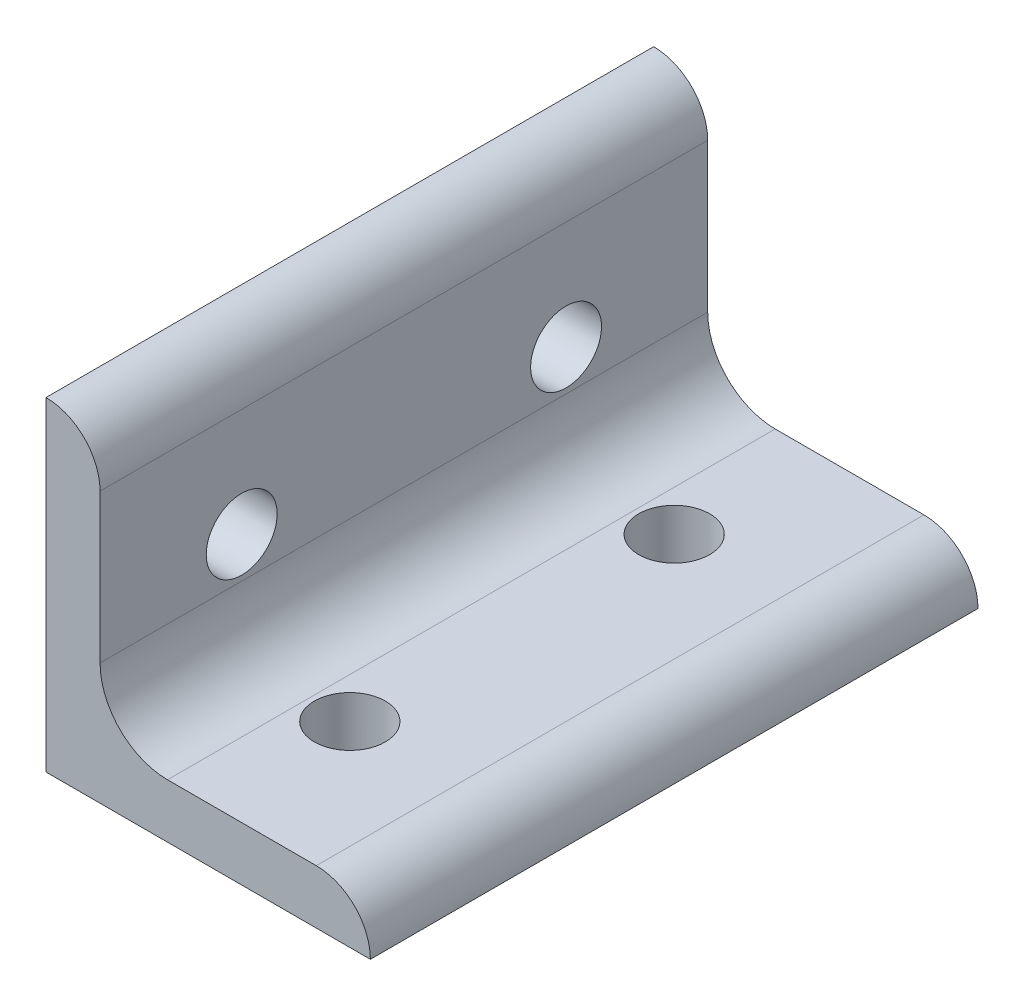
ISO-10303-21;
HEADER;
FILE_DESCRIPTION(('STEP AP214'),'2;1');
FILE_NAME('part.step','',(''),(''),'','','');
FILE_SCHEMA(('AUTOMOTIVE_DESIGN { 1 0 10303 214 1 1 1 1 }'));
ENDSEC;
DATA;
#1=APPLICATION_CONTEXT('core data for automotive mechanical design processes');
#2=APPLICATION_PROTOCOL_DEFINITION('international standard','automotive_design',2000,#1);
#3=PRODUCT_CONTEXT('',#1,'mechanical');
#4=PRODUCT('Part','Part','',(#3));
#5=PRODUCT_RELATED_PRODUCT_CATEGORY('part','',(#4));
#6=PRODUCT_DEFINITION_FORMATION('','',#4);
#7=PRODUCT_DEFINITION_CONTEXT('part definition',#1,'design');
#8=PRODUCT_DEFINITION('design','',#6,#7);
#9=PRODUCT_DEFINITION_SHAPE('','',#8);
#10=(LENGTH_UNIT() NAMED_UNIT(*) SI_UNIT(.MILLI.,.METRE.));
#11=(NAMED_UNIT(*) PLANE_ANGLE_UNIT() SI_UNIT($,.RADIAN.));
#12=(NAMED_UNIT(*) SI_UNIT($,.STERADIAN.) SOLID_ANGLE_UNIT());
#13=UNCERTAINTY_MEASURE_WITH_UNIT(LENGTH_MEASURE(1.E-05),#10,'distance_accuracy_value','');
#14=(GEOMETRIC_REPRESENTATION_CONTEXT(3) GLOBAL_UNCERTAINTY_ASSIGNED_CONTEXT((#13)) GLOBAL_UNIT_ASSIGNED_CONTEXT((#10,
#11,#12)) REPRESENTATION_CONTEXT('',''));
#15=CARTESIAN_POINT('',(0.,0.,0.));
#16=DIRECTION('',(0.,0.,1.));
#17=DIRECTION('',(1.,0.,0.));
#18=AXIS2_PLACEMENT_3D('',#15,#16,#17);
#19=CARTESIAN_POINT('',(6.35,31.75,35.687));
#20=DIRECTION('',(-1.,0.,0.));
#21=DIRECTION('',(0.,0.,1.));
#22=AXIS2_PLACEMENT_3D('',#19,#20,#21);
#23=PLANE('',#22);
#24=DIRECTION('',(0.,0.,-1.));
#25=VECTOR('',#24,1.);
#26=CARTESIAN_POINT('',(6.35,14.2748,35.687));
#27=LINE('',#26,#25);
#28=CARTESIAN_POINT('',(6.35,14.2748,35.687));
#29=VERTEX_POINT('',#28);
#30=CARTESIAN_POINT('',(6.35,14.2748,-35.687));
#31=VERTEX_POINT('',#30);
#32=EDGE_CURVE('E150',#29,#31,#27,.T.);
#33=ORIENTED_EDGE('',*,*,#32,.T.);
#34=DIRECTION('',(0.,1.,0.));
#35=VECTOR('',#34,1.);
#36=CARTESIAN_POINT('',(6.35,31.75,-35.687));
#37=LINE('',#36,#35);
#38=CARTESIAN_POINT('',(6.35,31.75,-35.687));
#39=VERTEX_POINT('',#38);
#40=EDGE_CURVE('E121',#31,#39,#37,.T.);
#41=ORIENTED_EDGE('',*,*,#40,.T.);
#42=DIRECTION('',(0.,0.,-1.));
#43=VECTOR('',#42,1.);
#44=CARTESIAN_POINT('',(6.35,31.75,35.687));
#45=LINE('',#44,#43);
#46=CARTESIAN_POINT('',(6.35,31.75,35.687));
#47=VERTEX_POINT('',#46);
#48=EDGE_CURVE('E148',#47,#39,#45,.T.);
#49=ORIENTED_EDGE('',*,*,#48,.F.);
#50=DIRECTION('',(0.,1.,0.));
#51=VECTOR('',#50,1.);
#52=CARTESIAN_POINT('',(6.35,31.75,35.687));
#53=LINE('',#52,#51);
#54=EDGE_CURVE('E137',#29,#47,#53,.T.);
#55=ORIENTED_EDGE('',*,*,#54,.F.);
#56=EDGE_LOOP('',(#33,#41,#49,#55));
#57=FACE_BOUND('',#56,.T.);
#58=CARTESIAN_POINT('',(6.35,19.05,19.05));
#59=DIRECTION('',(-1.,0.,0.));
#60=DIRECTION('',(0.,0.,1.));
#61=AXIS2_PLACEMENT_3D('',#58,#59,#60);
#62=CIRCLE('',#61,4.1656);
#63=CARTESIAN_POINT('',(6.35,19.05,23.2156));
#64=VERTEX_POINT('',#63);
#65=EDGE_CURVE('E182',#64,#64,#62,.F.);
#66=ORIENTED_EDGE('',*,*,#65,.F.);
#67=EDGE_LOOP('',(#66));
#68=FACE_BOUND('',#67,.T.);
#69=CARTESIAN_POINT('',(6.35,19.05,-19.05));
#70=DIRECTION('',(-1.,0.,0.));
#71=DIRECTION('',(0.,0.,1.));
#72=AXIS2_PLACEMENT_3D('',#69,#70,#71);
#73=CIRCLE('',#72,4.1656);
#74=CARTESIAN_POINT('',(6.35,19.05,-14.8844));
#75=VERTEX_POINT('',#74);
#76=EDGE_CURVE('E192',#75,#75,#73,.F.);
#77=ORIENTED_EDGE('',*,*,#76,.F.);
#78=EDGE_LOOP('',(#77));
#79=FACE_BOUND('',#78,.T.);
#80=ADVANCED_FACE('F34',(#57,#68,#79),#23,.F.);
#81=CARTESIAN_POINT('',(0.,0.,35.687));
#82=DIRECTION('',(1.,0.,0.));
#83=DIRECTION('',(0.,1.,0.));
#84=AXIS2_PLACEMENT_3D('',#81,#82,#83);
#85=PLANE('',#84);
#86=DIRECTION('',(0.,0.,-1.));
#87=VECTOR('',#86,1.);
#88=CARTESIAN_POINT('',(0.,38.1,35.687));
#89=LINE('',#88,#87);
#90=CARTESIAN_POINT('',(0.,38.1,35.687));
#91=VERTEX_POINT('',#90);
#92=CARTESIAN_POINT('',(0.,38.1,-35.687));
#93=VERTEX_POINT('',#92);
#94=EDGE_CURVE('E146',#91,#93,#89,.T.);
#95=ORIENTED_EDGE('',*,*,#94,.T.);
#96=DIRECTION('',(0.,-1.,0.));
#97=VECTOR('',#96,1.);
#98=CARTESIAN_POINT('',(0.,0.,-35.687));
#99=LINE('',#98,#97);
#100=CARTESIAN_POINT('',(0.,0.,-35.687));
#101=VERTEX_POINT('',#100);
#102=EDGE_CURVE('E127',#93,#101,#99,.T.);
#103=ORIENTED_EDGE('',*,*,#102,.T.);
#104=DIRECTION('',(0.,0.,-1.));
#105=VECTOR('',#104,1.);
#106=CARTESIAN_POINT('',(0.,0.,35.687));
#107=LINE('',#106,#105);
#108=CARTESIAN_POINT('',(0.,0.,35.687));
#109=VERTEX_POINT('',#108);
#110=EDGE_CURVE('E144',#109,#101,#107,.T.);
#111=ORIENTED_EDGE('',*,*,#110,.F.);
#112=DIRECTION('',(0.,-1.,0.));
#113=VECTOR('',#112,1.);
#114=CARTESIAN_POINT('',(0.,0.,35.687));
#115=LINE('',#114,#113);
#116=EDGE_CURVE('E54',#91,#109,#115,.T.);
#117=ORIENTED_EDGE('',*,*,#116,.F.);
#118=EDGE_LOOP('',(#95,#103,#111,#117));
#119=FACE_BOUND('',#118,.T.);
#120=CARTESIAN_POINT('',(0.,19.05,19.05));
#121=DIRECTION('',(1.,0.,0.));
#122=DIRECTION('',(0.,0.,-1.));
#123=AXIS2_PLACEMENT_3D('',#120,#121,#122);
#124=CIRCLE('',#123,4.1656);
#125=CARTESIAN_POINT('',(0.,19.05,14.8844));
#126=VERTEX_POINT('',#125);
#127=EDGE_CURVE('E187',#126,#126,#124,.T.);
#128=ORIENTED_EDGE('',*,*,#127,.T.);
#129=EDGE_LOOP('',(#128));
#130=FACE_BOUND('',#129,.T.);
#131=CARTESIAN_POINT('',(0.,19.05,-19.05));
#132=DIRECTION('',(1.,0.,0.));
#133=DIRECTION('',(0.,0.,-1.));
#134=AXIS2_PLACEMENT_3D('',#131,#132,#133);
#135=CIRCLE('',#134,4.1656);
#136=CARTESIAN_POINT('',(0.,19.05,-23.2156));
#137=VERTEX_POINT('',#136);
#138=EDGE_CURVE('E195',#137,#137,#135,.T.);
#139=ORIENTED_EDGE('',*,*,#138,.T.);
#140=EDGE_LOOP('',(#139));
#141=FACE_BOUND('',#140,.T.);
#142=ADVANCED_FACE('F167',(#119,#130,#141),#85,.F.);
#143=CARTESIAN_POINT('',(14.2748,6.35,35.687));
#144=DIRECTION('',(0.,-1.,0.));
#145=DIRECTION('',(1.,0.,0.));
#146=AXIS2_PLACEMENT_3D('',#143,#144,#145);
#147=PLANE('',#146);
#148=DIRECTION('',(0.,0.,-1.));
#149=VECTOR('',#148,1.);
#150=CARTESIAN_POINT('',(31.75,6.35,35.687));
#151=LINE('',#150,#149);
#152=CARTESIAN_POINT('',(31.75,6.35,35.687));
#153=VERTEX_POINT('',#152);
#154=CARTESIAN_POINT('',(31.75,6.35,-35.687));
#155=VERTEX_POINT('',#154);
#156=EDGE_CURVE('E11',#153,#155,#151,.T.);
#157=ORIENTED_EDGE('',*,*,#156,.T.);
#158=DIRECTION('',(-1.,0.,0.));
#159=VECTOR('',#158,1.);
#160=CARTESIAN_POINT('',(14.2748,6.35,-35.687));
#161=LINE('',#160,#159);
#162=CARTESIAN_POINT('',(14.2748,6.35,-35.687));
#163=VERTEX_POINT('',#162);
#164=EDGE_CURVE('E96',#155,#163,#161,.T.);
#165=ORIENTED_EDGE('',*,*,#164,.T.);
#166=DIRECTION('',(0.,0.,-1.));
#167=VECTOR('',#166,1.);
#168=CARTESIAN_POINT('',(14.2748,6.35,35.687));
#169=LINE('',#168,#167);
#170=CARTESIAN_POINT('',(14.2748,6.35,35.687));
#171=VERTEX_POINT('',#170);
#172=EDGE_CURVE('E42',#171,#163,#169,.T.);
#173=ORIENTED_EDGE('',*,*,#172,.F.);
#174=DIRECTION('',(-1.,0.,0.));
#175=VECTOR('',#174,1.);
#176=CARTESIAN_POINT('',(14.2748,6.35,35.687));
#177=LINE('',#176,#175);
#178=EDGE_CURVE('E97',#153,#171,#177,.T.);
#179=ORIENTED_EDGE('',*,*,#178,.F.);
#180=EDGE_LOOP('',(#157,#165,#173,#179));
#181=FACE_BOUND('',#180,.T.);
#182=CARTESIAN_POINT('',(19.05,6.35,19.05));
#183=DIRECTION('',(0.,-1.,0.));
#184=DIRECTION('',(1.,0.,0.));
#185=AXIS2_PLACEMENT_3D('',#182,#183,#184);
#186=CIRCLE('',#185,4.16560000000001);
#187=CARTESIAN_POINT('',(23.2156,6.35,19.05));
#188=VERTEX_POINT('',#187);
#189=EDGE_CURVE('E113',#188,#188,#186,.F.);
#190=ORIENTED_EDGE('',*,*,#189,.F.);
#191=EDGE_LOOP('',(#190));
#192=FACE_BOUND('',#191,.T.);
#193=CARTESIAN_POINT('',(19.05,6.35,-19.05));
#194=DIRECTION('',(0.,-1.,0.));
#195=DIRECTION('',(1.,0.,0.));
#196=AXIS2_PLACEMENT_3D('',#193,#194,#195);
#197=CIRCLE('',#196,4.1656);
#198=CARTESIAN_POINT('',(23.2156,6.35,-19.05));
#199=VERTEX_POINT('',#198);
#200=EDGE_CURVE('E181',#199,#199,#197,.F.);
#201=ORIENTED_EDGE('',*,*,#200,.F.);
#202=EDGE_LOOP('',(#201));
#203=FACE_BOUND('',#202,.T.);
#204=ADVANCED_FACE('F93',(#181,#192,#203),#147,.F.);
#205=CARTESIAN_POINT('',(38.1,0.,35.687));
#206=DIRECTION('',(0.,1.,0.));
#207=DIRECTION('',(-1.,0.,0.));
#208=AXIS2_PLACEMENT_3D('',#205,#206,#207);
#209=PLANE('',#208);
#210=ORIENTED_EDGE('',*,*,#110,.T.);
#211=DIRECTION('',(1.,0.,0.));
#212=VECTOR('',#211,1.);
#213=CARTESIAN_POINT('',(38.1,0.,-35.687));
#214=LINE('',#213,#212);
#215=CARTESIAN_POINT('',(38.1,0.,-35.687));
#216=VERTEX_POINT('',#215);
#217=EDGE_CURVE('E130',#101,#216,#214,.T.);
#218=ORIENTED_EDGE('',*,*,#217,.T.);
#219=DIRECTION('',(0.,0.,-1.));
#220=VECTOR('',#219,1.);
#221=CARTESIAN_POINT('',(38.1,0.,35.687));
#222=LINE('',#221,#220);
#223=CARTESIAN_POINT('',(38.1,0.,35.687));
#224=VERTEX_POINT('',#223);
#225=EDGE_CURVE('E112',#224,#216,#222,.T.);
#226=ORIENTED_EDGE('',*,*,#225,.F.);
#227=DIRECTION('',(1.,0.,0.));
#228=VECTOR('',#227,1.);
#229=CARTESIAN_POINT('',(38.1,0.,35.687));
#230=LINE('',#229,#228);
#231=EDGE_CURVE('E49',#109,#224,#230,.T.);
#232=ORIENTED_EDGE('',*,*,#231,.F.);
#233=EDGE_LOOP('',(#210,#218,#226,#232));
#234=FACE_BOUND('',#233,.T.);
#235=CARTESIAN_POINT('',(19.05,0.,19.05));
#236=DIRECTION('',(0.,1.,0.));
#237=DIRECTION('',(0.,0.,1.));
#238=AXIS2_PLACEMENT_3D('',#235,#236,#237);
#239=CIRCLE('',#238,4.16560000000001);
#240=CARTESIAN_POINT('',(19.05,0.,23.2156));
#241=VERTEX_POINT('',#240);
#242=EDGE_CURVE('E116',#241,#241,#239,.T.);
#243=ORIENTED_EDGE('',*,*,#242,.T.);
#244=EDGE_LOOP('',(#243));
#245=FACE_BOUND('',#244,.T.);
#246=CARTESIAN_POINT('',(19.05,0.,-19.05));
#247=DIRECTION('',(0.,1.,0.));
#248=DIRECTION('',(0.,0.,1.));
#249=AXIS2_PLACEMENT_3D('',#246,#247,#248);
#250=CIRCLE('',#249,4.1656);
#251=CARTESIAN_POINT('',(19.05,0.,-14.8844));
#252=VERTEX_POINT('',#251);
#253=EDGE_CURVE('E179',#252,#252,#250,.T.);
#254=ORIENTED_EDGE('',*,*,#253,.T.);
#255=EDGE_LOOP('',(#254));
#256=FACE_BOUND('',#255,.T.);
#257=ADVANCED_FACE('F170',(#234,#245,#256),#209,.F.);
#258=CARTESIAN_POINT('',(31.75,0.,35.687));
#259=DIRECTION('',(0.,0.,-1.));
#260=DIRECTION('',(-1.,0.,0.));
#261=AXIS2_PLACEMENT_3D('',#258,#259,#260);
#262=CYLINDRICAL_SURFACE('',#261,6.35);
#263=ORIENTED_EDGE('',*,*,#225,.T.);
#264=CARTESIAN_POINT('',(31.75,0.,-35.687));
#265=DIRECTION('',(0.,0.,1.));
#266=DIRECTION('',(1.,0.,0.));
#267=AXIS2_PLACEMENT_3D('',#264,#265,#266);
#268=CIRCLE('',#267,6.35);
#269=EDGE_CURVE('E106',#216,#155,#268,.T.);
#270=ORIENTED_EDGE('',*,*,#269,.T.);
#271=ORIENTED_EDGE('',*,*,#156,.F.);
#272=CARTESIAN_POINT('',(31.75,0.,35.687));
#273=DIRECTION('',(0.,0.,1.));
#274=DIRECTION('',(1.,0.,0.));
#275=AXIS2_PLACEMENT_3D('',#272,#273,#274);
#276=CIRCLE('',#275,6.35);
#277=EDGE_CURVE('E132',#224,#153,#276,.T.);
#278=ORIENTED_EDGE('',*,*,#277,.F.);
#279=EDGE_LOOP('',(#263,#270,#271,#278));
#280=FACE_BOUND('',#279,.T.);
#281=ADVANCED_FACE('F36',(#280),#262,.T.);
#282=CARTESIAN_POINT('',(14.2748,14.2748,35.687));
#283=DIRECTION('',(0.,0.,-1.));
#284=DIRECTION('',(-1.,0.,0.));
#285=AXIS2_PLACEMENT_3D('',#282,#283,#284);
#286=CYLINDRICAL_SURFACE('',#285,7.9248);
#287=ORIENTED_EDGE('',*,*,#172,.T.);
#288=CARTESIAN_POINT('',(14.2748,14.2748,-35.687));
#289=DIRECTION('',(0.,0.,-1.));
#290=DIRECTION('',(1.,0.,0.));
#291=AXIS2_PLACEMENT_3D('',#288,#289,#290);
#292=CIRCLE('',#291,7.9248);
#293=EDGE_CURVE('E110',#163,#31,#292,.T.);
#294=ORIENTED_EDGE('',*,*,#293,.T.);
#295=ORIENTED_EDGE('',*,*,#32,.F.);
#296=CARTESIAN_POINT('',(14.2748,14.2748,35.687));
#297=DIRECTION('',(0.,0.,-1.));
#298=DIRECTION('',(1.,0.,0.));
#299=AXIS2_PLACEMENT_3D('',#296,#297,#298);
#300=CIRCLE('',#299,7.9248);
#301=EDGE_CURVE('E135',#171,#29,#300,.T.);
#302=ORIENTED_EDGE('',*,*,#301,.F.);
#303=EDGE_LOOP('',(#287,#294,#295,#302));
#304=FACE_BOUND('',#303,.T.);
#305=ADVANCED_FACE('F153',(#304),#286,.F.);
#306=CARTESIAN_POINT('',(0.,31.75,35.687));
#307=DIRECTION('',(0.,0.,-1.));
#308=DIRECTION('',(-1.,0.,0.));
#309=AXIS2_PLACEMENT_3D('',#306,#307,#308);
#310=CYLINDRICAL_SURFACE('',#309,6.35);
#311=ORIENTED_EDGE('',*,*,#48,.T.);
#312=CARTESIAN_POINT('',(0.,31.75,-35.687));
#313=DIRECTION('',(0.,0.,1.));
#314=DIRECTION('',(1.,0.,0.));
#315=AXIS2_PLACEMENT_3D('',#312,#313,#314);
#316=CIRCLE('',#315,6.35);
#317=EDGE_CURVE('E124',#39,#93,#316,.T.);
#318=ORIENTED_EDGE('',*,*,#317,.T.);
#319=ORIENTED_EDGE('',*,*,#94,.F.);
#320=CARTESIAN_POINT('',(0.,31.75,35.687));
#321=DIRECTION('',(0.,0.,1.));
#322=DIRECTION('',(1.,0.,0.));
#323=AXIS2_PLACEMENT_3D('',#320,#321,#322);
#324=CIRCLE('',#323,6.35);
#325=EDGE_CURVE('E139',#47,#91,#324,.T.);
#326=ORIENTED_EDGE('',*,*,#325,.F.);
#327=EDGE_LOOP('',(#311,#318,#319,#326));
#328=FACE_BOUND('',#327,.T.);
#329=ADVANCED_FACE('F164',(#328),#310,.T.);
#330=CARTESIAN_POINT('',(31.75,0.,35.687));
#331=DIRECTION('',(0.,0.,1.));
#332=DIRECTION('',(1.,0.,0.));
#333=AXIS2_PLACEMENT_3D('',#330,#331,#332);
#334=PLANE('',#333);
#335=ORIENTED_EDGE('',*,*,#277,.T.);
#336=ORIENTED_EDGE('',*,*,#178,.T.);
#337=ORIENTED_EDGE('',*,*,#301,.T.);
#338=ORIENTED_EDGE('',*,*,#54,.T.);
#339=ORIENTED_EDGE('',*,*,#325,.T.);
#340=ORIENTED_EDGE('',*,*,#116,.T.);
#341=ORIENTED_EDGE('',*,*,#231,.T.);
#342=EDGE_LOOP('',(#335,#336,#337,#338,#339,#340,#341));
#343=FACE_BOUND('',#342,.T.);
#344=ADVANCED_FACE('F156',(#343),#334,.T.);
#345=CARTESIAN_POINT('',(31.75,0.,-35.687));
#346=DIRECTION('',(0.,0.,1.));
#347=DIRECTION('',(1.,0.,0.));
#348=AXIS2_PLACEMENT_3D('',#345,#346,#347);
#349=PLANE('',#348);
#350=ORIENTED_EDGE('',*,*,#269,.F.);
#351=ORIENTED_EDGE('',*,*,#217,.F.);
#352=ORIENTED_EDGE('',*,*,#102,.F.);
#353=ORIENTED_EDGE('',*,*,#317,.F.);
#354=ORIENTED_EDGE('',*,*,#40,.F.);
#355=ORIENTED_EDGE('',*,*,#293,.F.);
#356=ORIENTED_EDGE('',*,*,#164,.F.);
#357=EDGE_LOOP('',(#350,#351,#352,#353,#354,#355,#356));
#358=FACE_BOUND('',#357,.T.);
#359=ADVANCED_FACE('F104',(#358),#349,.F.);
#360=CARTESIAN_POINT('',(19.05,38.1,19.05));
#361=DIRECTION('',(0.,-1.,0.));
#362=DIRECTION('',(0.,0.,-1.));
#363=AXIS2_PLACEMENT_3D('',#360,#361,#362);
#364=CYLINDRICAL_SURFACE('',#363,4.16560000000001);
#365=ORIENTED_EDGE('',*,*,#242,.F.);
#366=EDGE_LOOP('',(#365));
#367=FACE_BOUND('',#366,.T.);
#368=ORIENTED_EDGE('',*,*,#189,.T.);
#369=EDGE_LOOP('',(#368));
#370=FACE_BOUND('',#369,.T.);
#371=ADVANCED_FACE('F252',(#367,#370),#364,.F.);
#372=CARTESIAN_POINT('',(19.05,38.1,-19.05));
#373=DIRECTION('',(0.,-1.,0.));
#374=DIRECTION('',(0.,0.,-1.));
#375=AXIS2_PLACEMENT_3D('',#372,#373,#374);
#376=CYLINDRICAL_SURFACE('',#375,4.1656);
#377=ORIENTED_EDGE('',*,*,#253,.F.);
#378=EDGE_LOOP('',(#377));
#379=FACE_BOUND('',#378,.T.);
#380=ORIENTED_EDGE('',*,*,#200,.T.);
#381=EDGE_LOOP('',(#380));
#382=FACE_BOUND('',#381,.T.);
#383=ADVANCED_FACE('F258',(#379,#382),#376,.F.);
#384=CARTESIAN_POINT('',(38.1,19.05,19.05));
#385=DIRECTION('',(-1.,0.,0.));
#386=DIRECTION('',(0.,0.,1.));
#387=AXIS2_PLACEMENT_3D('',#384,#385,#386);
#388=CYLINDRICAL_SURFACE('',#387,4.1656);
#389=ORIENTED_EDGE('',*,*,#127,.F.);
#390=EDGE_LOOP('',(#389));
#391=FACE_BOUND('',#390,.T.);
#392=ORIENTED_EDGE('',*,*,#65,.T.);
#393=EDGE_LOOP('',(#392));
#394=FACE_BOUND('',#393,.T.);
#395=ADVANCED_FACE('F203',(#391,#394),#388,.F.);
#396=CARTESIAN_POINT('',(38.1,19.05,-19.05));
#397=DIRECTION('',(-1.,0.,0.));
#398=DIRECTION('',(0.,0.,1.));
#399=AXIS2_PLACEMENT_3D('',#396,#397,#398);
#400=CYLINDRICAL_SURFACE('',#399,4.1656);
#401=ORIENTED_EDGE('',*,*,#138,.F.);
#402=EDGE_LOOP('',(#401));
#403=FACE_BOUND('',#402,.T.);
#404=ORIENTED_EDGE('',*,*,#76,.T.);
#405=EDGE_LOOP('',(#404));
#406=FACE_BOUND('',#405,.T.);
#407=ADVANCED_FACE('F200',(#403,#406),#400,.F.);
#408=CLOSED_SHELL('',(#80,#142,#204,#257,#281,#305,#329,#344,#359,#371,#383,#395,#407));
#409=MANIFOLD_SOLID_BREP('B2',#408);
#410=ADVANCED_BREP_SHAPE_REPRESENTATION('',(#18,#409),#14);
#411=SHAPE_DEFINITION_REPRESENTATION(#9,#410);
ENDSEC;
END-ISO-10303-21;
